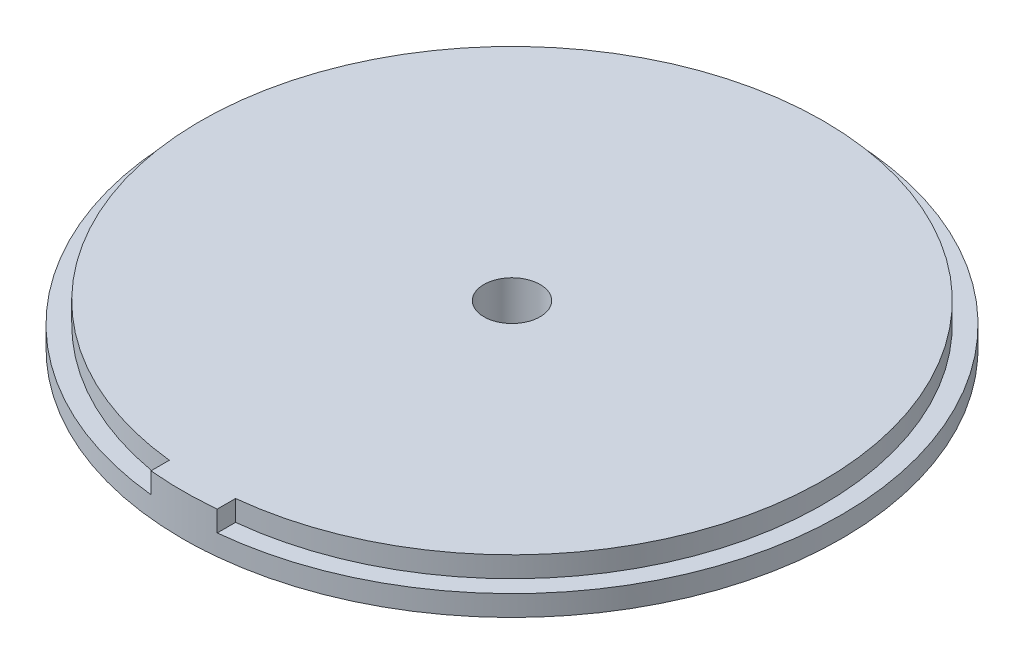
ISO-10303-21;
HEADER;
FILE_DESCRIPTION(('STEP AP214'),'2;1');
FILE_NAME('part.step','',(''),(''),'','','');
FILE_SCHEMA(('AUTOMOTIVE_DESIGN { 1 0 10303 214 1 1 1 1 }'));
ENDSEC;
DATA;
#1=APPLICATION_CONTEXT('core data for automotive mechanical design processes');
#2=APPLICATION_PROTOCOL_DEFINITION('international standard','automotive_design',2000,#1);
#3=PRODUCT_CONTEXT('',#1,'mechanical');
#4=PRODUCT('Part','Part','',(#3));
#5=PRODUCT_RELATED_PRODUCT_CATEGORY('part','',(#4));
#6=PRODUCT_DEFINITION_FORMATION('','',#4);
#7=PRODUCT_DEFINITION_CONTEXT('part definition',#1,'design');
#8=PRODUCT_DEFINITION('design','',#6,#7);
#9=PRODUCT_DEFINITION_SHAPE('','',#8);
#10=(LENGTH_UNIT() NAMED_UNIT(*) SI_UNIT(.MILLI.,.METRE.));
#11=(NAMED_UNIT(*) PLANE_ANGLE_UNIT() SI_UNIT($,.RADIAN.));
#12=(NAMED_UNIT(*) SI_UNIT($,.STERADIAN.) SOLID_ANGLE_UNIT());
#13=UNCERTAINTY_MEASURE_WITH_UNIT(LENGTH_MEASURE(1.E-05),#10,'distance_accuracy_value','');
#14=(GEOMETRIC_REPRESENTATION_CONTEXT(3) GLOBAL_UNCERTAINTY_ASSIGNED_CONTEXT((#13)) GLOBAL_UNIT_ASSIGNED_CONTEXT((#10,
#11,#12)) REPRESENTATION_CONTEXT('',''));
#15=CARTESIAN_POINT('',(0.,0.,0.));
#16=DIRECTION('',(0.,0.,1.));
#17=DIRECTION('',(1.,0.,0.));
#18=AXIS2_PLACEMENT_3D('',#15,#16,#17);
#19=CARTESIAN_POINT('',(0.,1.5875,0.));
#20=DIRECTION('',(0.,1.,0.));
#21=DIRECTION('',(0.,0.,1.));
#22=AXIS2_PLACEMENT_3D('',#19,#20,#21);
#23=PLANE('',#22);
#24=CARTESIAN_POINT('',(0.,1.5875,0.));
#25=DIRECTION('',(0.,1.,0.));
#26=DIRECTION('',(0.,0.,1.));
#27=AXIS2_PLACEMENT_3D('',#24,#25,#26);
#28=CIRCLE('',#27,23.876);
#29=CARTESIAN_POINT('',(2.54,1.5875,23.7405091773534));
#30=VERTEX_POINT('',#29);
#31=CARTESIAN_POINT('',(-2.54,1.5875,23.7405091773534));
#32=VERTEX_POINT('',#31);
#33=EDGE_CURVE('E11',#30,#32,#28,.T.);
#34=ORIENTED_EDGE('',*,*,#33,.F.);
#35=DIRECTION('',(0.,0.,-1.));
#36=VECTOR('',#35,1.);
#37=CARTESIAN_POINT('',(2.54,1.5875,25.1450378603811));
#38=LINE('',#37,#36);
#39=CARTESIAN_POINT('',(2.54,1.5875,25.1450378603811));
#40=VERTEX_POINT('',#39);
#41=EDGE_CURVE('E117',#40,#30,#38,.T.);
#42=ORIENTED_EDGE('',*,*,#41,.F.);
#43=CARTESIAN_POINT('',(0.,1.5875,0.));
#44=DIRECTION('',(0.,1.,0.));
#45=DIRECTION('',(0.,0.,1.));
#46=AXIS2_PLACEMENT_3D('',#43,#44,#45);
#47=CIRCLE('',#46,25.273);
#48=CARTESIAN_POINT('',(-2.54,1.5875,25.1450378603811));
#49=VERTEX_POINT('',#48);
#50=EDGE_CURVE('E53',#40,#49,#47,.T.);
#51=ORIENTED_EDGE('',*,*,#50,.T.);
#52=DIRECTION('',(0.,0.,1.));
#53=VECTOR('',#52,1.);
#54=CARTESIAN_POINT('',(-2.54,1.5875,25.1450378603811));
#55=LINE('',#54,#53);
#56=EDGE_CURVE('E93',#32,#49,#55,.T.);
#57=ORIENTED_EDGE('',*,*,#56,.F.);
#58=EDGE_LOOP('',(#34,#42,#51,#57));
#59=FACE_BOUND('',#58,.T.);
#60=ADVANCED_FACE('F43',(#59),#23,.T.);
#61=CARTESIAN_POINT('',(0.,3.175,0.));
#62=DIRECTION('',(0.,-1.,0.));
#63=DIRECTION('',(0.,0.,-1.));
#64=AXIS2_PLACEMENT_3D('',#61,#62,#63);
#65=CYLINDRICAL_SURFACE('',#64,23.876);
#66=DIRECTION('',(0.,-1.,0.));
#67=VECTOR('',#66,1.);
#68=CARTESIAN_POINT('',(2.54,8.48112175901535,23.7405091773534));
#69=LINE('',#68,#67);
#70=CARTESIAN_POINT('',(2.54,3.175,23.7405091773534));
#71=VERTEX_POINT('',#70);
#72=EDGE_CURVE('E102',#71,#30,#69,.T.);
#73=ORIENTED_EDGE('',*,*,#72,.T.);
#74=ORIENTED_EDGE('',*,*,#33,.T.);
#75=DIRECTION('',(0.,-1.,0.));
#76=VECTOR('',#75,1.);
#77=CARTESIAN_POINT('',(-2.54,8.48112175901535,23.7405091773534));
#78=LINE('',#77,#76);
#79=CARTESIAN_POINT('',(-2.54,3.175,23.7405091773534));
#80=VERTEX_POINT('',#79);
#81=EDGE_CURVE('E89',#80,#32,#78,.T.);
#82=ORIENTED_EDGE('',*,*,#81,.F.);
#83=CARTESIAN_POINT('',(0.,3.175,0.));
#84=DIRECTION('',(0.,1.,0.));
#85=DIRECTION('',(0.,0.,1.));
#86=AXIS2_PLACEMENT_3D('',#83,#84,#85);
#87=CIRCLE('',#86,23.876);
#88=EDGE_CURVE('E99',#71,#80,#87,.T.);
#89=ORIENTED_EDGE('',*,*,#88,.F.);
#90=EDGE_LOOP('',(#73,#74,#82,#89));
#91=FACE_BOUND('',#90,.T.);
#92=ADVANCED_FACE('F98',(#91),#65,.T.);
#93=CARTESIAN_POINT('',(0.,1.5875,0.));
#94=DIRECTION('',(0.,-1.,0.));
#95=DIRECTION('',(0.,0.,-1.));
#96=AXIS2_PLACEMENT_3D('',#93,#94,#95);
#97=CYLINDRICAL_SURFACE('',#96,25.273);
#98=ORIENTED_EDGE('',*,*,#50,.F.);
#99=DIRECTION('',(0.,-1.,0.));
#100=VECTOR('',#99,1.);
#101=CARTESIAN_POINT('',(2.54,8.48112175901535,25.1450378603811));
#102=LINE('',#101,#100);
#103=CARTESIAN_POINT('',(2.54,3.175,25.1450378603811));
#104=VERTEX_POINT('',#103);
#105=EDGE_CURVE('E121',#104,#40,#102,.T.);
#106=ORIENTED_EDGE('',*,*,#105,.F.);
#107=CARTESIAN_POINT('',(0.,3.175,0.));
#108=DIRECTION('',(0.,1.,0.));
#109=DIRECTION('',(0.,0.,1.));
#110=AXIS2_PLACEMENT_3D('',#107,#108,#109);
#111=CIRCLE('',#110,25.273);
#112=CARTESIAN_POINT('',(-2.54,3.175,25.1450378603811));
#113=VERTEX_POINT('',#112);
#114=EDGE_CURVE('E92',#113,#104,#111,.T.);
#115=ORIENTED_EDGE('',*,*,#114,.F.);
#116=DIRECTION('',(0.,-1.,0.));
#117=VECTOR('',#116,1.);
#118=CARTESIAN_POINT('',(-2.54,8.48112175901535,25.1450378603811));
#119=LINE('',#118,#117);
#120=EDGE_CURVE('E69',#113,#49,#119,.T.);
#121=ORIENTED_EDGE('',*,*,#120,.T.);
#122=EDGE_LOOP('',(#98,#106,#115,#121));
#123=FACE_BOUND('',#122,.T.);
#124=CARTESIAN_POINT('',(0.,0.,0.));
#125=DIRECTION('',(0.,1.,0.));
#126=DIRECTION('',(0.,0.,1.));
#127=AXIS2_PLACEMENT_3D('',#124,#125,#126);
#128=CIRCLE('',#127,25.273);
#129=CARTESIAN_POINT('',(0.,0.,25.273));
#130=VERTEX_POINT('',#129);
#131=EDGE_CURVE('E47',#130,#130,#128,.T.);
#132=ORIENTED_EDGE('',*,*,#131,.T.);
#133=EDGE_LOOP('',(#132));
#134=FACE_BOUND('',#133,.T.);
#135=ADVANCED_FACE('F45',(#123,#134),#97,.T.);
#136=CARTESIAN_POINT('',(0.,0.,0.));
#137=DIRECTION('',(0.,1.,0.));
#138=DIRECTION('',(0.,0.,1.));
#139=AXIS2_PLACEMENT_3D('',#136,#137,#138);
#140=PLANE('',#139);
#141=CARTESIAN_POINT('',(0.,0.,0.));
#142=DIRECTION('',(0.,1.,0.));
#143=DIRECTION('',(0.,0.,1.));
#144=AXIS2_PLACEMENT_3D('',#141,#142,#143);
#145=CIRCLE('',#144,2.15265);
#146=CARTESIAN_POINT('',(0.,0.,2.15265));
#147=VERTEX_POINT('',#146);
#148=EDGE_CURVE('E123',#147,#147,#145,.T.);
#149=ORIENTED_EDGE('',*,*,#148,.T.);
#150=EDGE_LOOP('',(#149));
#151=FACE_BOUND('',#150,.T.);
#152=ORIENTED_EDGE('',*,*,#131,.F.);
#153=EDGE_LOOP('',(#152));
#154=FACE_BOUND('',#153,.T.);
#155=ADVANCED_FACE('F146',(#151,#154),#140,.F.);
#156=CARTESIAN_POINT('',(0.,3.175,0.));
#157=DIRECTION('',(0.,1.,0.));
#158=DIRECTION('',(0.,0.,1.));
#159=AXIS2_PLACEMENT_3D('',#156,#157,#158);
#160=PLANE('',#159);
#161=CARTESIAN_POINT('',(0.,3.175,0.));
#162=DIRECTION('',(0.,1.,0.));
#163=DIRECTION('',(0.,0.,1.));
#164=AXIS2_PLACEMENT_3D('',#161,#162,#163);
#165=CIRCLE('',#164,2.15265);
#166=CARTESIAN_POINT('',(0.,3.175,2.15265));
#167=VERTEX_POINT('',#166);
#168=EDGE_CURVE('E166',#167,#167,#165,.T.);
#169=ORIENTED_EDGE('',*,*,#168,.F.);
#170=EDGE_LOOP('',(#169));
#171=FACE_BOUND('',#170,.T.);
#172=ORIENTED_EDGE('',*,*,#88,.T.);
#173=DIRECTION('',(0.,0.,1.));
#174=VECTOR('',#173,1.);
#175=CARTESIAN_POINT('',(-2.54,3.175,25.1450378603811));
#176=LINE('',#175,#174);
#177=EDGE_CURVE('E86',#80,#113,#176,.T.);
#178=ORIENTED_EDGE('',*,*,#177,.T.);
#179=ORIENTED_EDGE('',*,*,#114,.T.);
#180=DIRECTION('',(0.,0.,-1.));
#181=VECTOR('',#180,1.);
#182=CARTESIAN_POINT('',(2.54,3.175,25.1450378603811));
#183=LINE('',#182,#181);
#184=EDGE_CURVE('E61',#104,#71,#183,.T.);
#185=ORIENTED_EDGE('',*,*,#184,.T.);
#186=EDGE_LOOP('',(#172,#178,#179,#185));
#187=FACE_BOUND('',#186,.T.);
#188=ADVANCED_FACE('F104',(#171,#187),#160,.T.);
#189=CARTESIAN_POINT('',(2.54,8.48112175901535,25.1450378603811));
#190=DIRECTION('',(-1.,0.,0.));
#191=DIRECTION('',(0.,0.,1.));
#192=AXIS2_PLACEMENT_3D('',#189,#190,#191);
#193=PLANE('',#192);
#194=ORIENTED_EDGE('',*,*,#184,.F.);
#195=ORIENTED_EDGE('',*,*,#105,.T.);
#196=ORIENTED_EDGE('',*,*,#41,.T.);
#197=ORIENTED_EDGE('',*,*,#72,.F.);
#198=EDGE_LOOP('',(#194,#195,#196,#197));
#199=FACE_BOUND('',#198,.T.);
#200=ADVANCED_FACE('F137',(#199),#193,.F.);
#201=CARTESIAN_POINT('',(-2.54,8.48112175901535,25.1450378603811));
#202=DIRECTION('',(1.,0.,0.));
#203=DIRECTION('',(0.,0.,-1.));
#204=AXIS2_PLACEMENT_3D('',#201,#202,#203);
#205=PLANE('',#204);
#206=ORIENTED_EDGE('',*,*,#177,.F.);
#207=ORIENTED_EDGE('',*,*,#81,.T.);
#208=ORIENTED_EDGE('',*,*,#56,.T.);
#209=ORIENTED_EDGE('',*,*,#120,.F.);
#210=EDGE_LOOP('',(#206,#207,#208,#209));
#211=FACE_BOUND('',#210,.T.);
#212=ADVANCED_FACE('F88',(#211),#205,.F.);
#213=CARTESIAN_POINT('',(0.,3.175,0.));
#214=DIRECTION('',(0.,1.,0.));
#215=DIRECTION('',(0.,0.,1.));
#216=AXIS2_PLACEMENT_3D('',#213,#214,#215);
#217=CYLINDRICAL_SURFACE('',#216,2.15265);
#218=ORIENTED_EDGE('',*,*,#148,.F.);
#219=EDGE_LOOP('',(#218));
#220=FACE_BOUND('',#219,.T.);
#221=ORIENTED_EDGE('',*,*,#168,.T.);
#222=EDGE_LOOP('',(#221));
#223=FACE_BOUND('',#222,.T.);
#224=ADVANCED_FACE('F144',(#220,#223),#217,.F.);
#225=CLOSED_SHELL('',(#60,#92,#135,#155,#188,#200,#212,#224));
#226=MANIFOLD_SOLID_BREP('B2',#225);
#227=ADVANCED_BREP_SHAPE_REPRESENTATION('',(#18,#226),#14);
#228=SHAPE_DEFINITION_REPRESENTATION(#9,#227);
ENDSEC;
END-ISO-10303-21;
